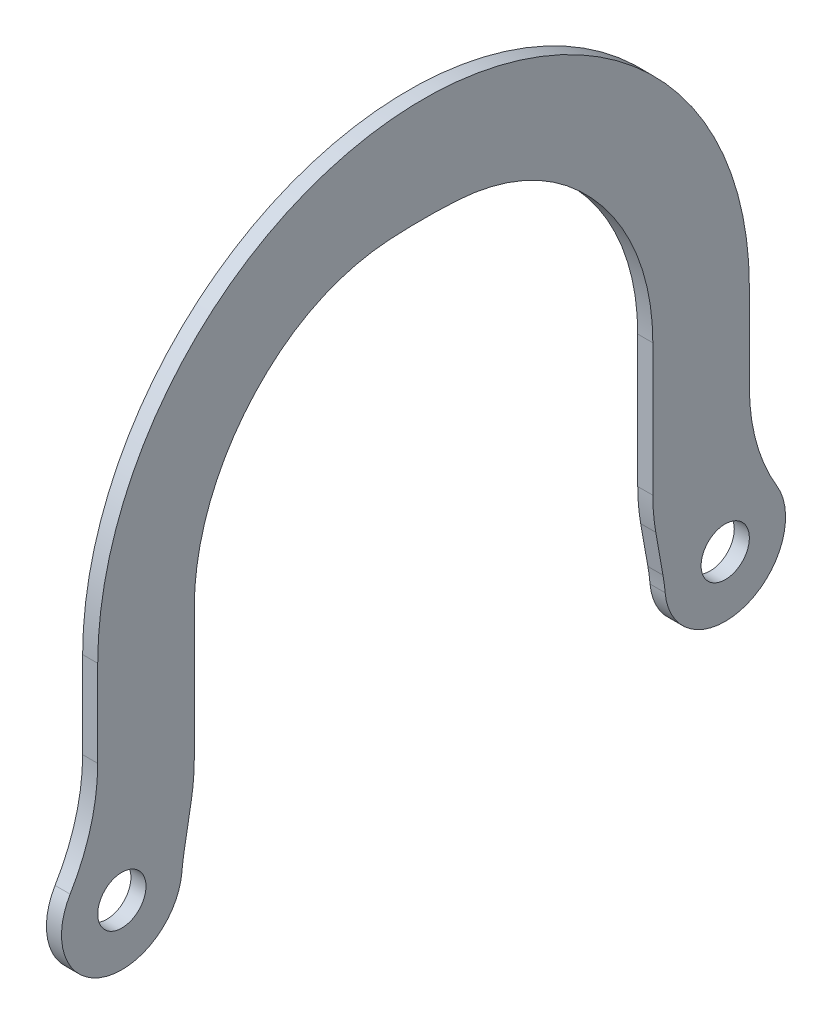
ISO-10303-21;
HEADER;
FILE_DESCRIPTION(('STEP AP214'),'2;1');
FILE_NAME('part.step','',(''),(''),'','','');
FILE_SCHEMA(('AUTOMOTIVE_DESIGN { 1 0 10303 214 1 1 1 1 }'));
ENDSEC;
DATA;
#1=APPLICATION_CONTEXT('core data for automotive mechanical design processes');
#2=APPLICATION_PROTOCOL_DEFINITION('international standard','automotive_design',2000,#1);
#3=PRODUCT_CONTEXT('',#1,'mechanical');
#4=PRODUCT('Part','Part','',(#3));
#5=PRODUCT_RELATED_PRODUCT_CATEGORY('part','',(#4));
#6=PRODUCT_DEFINITION_FORMATION('','',#4);
#7=PRODUCT_DEFINITION_CONTEXT('part definition',#1,'design');
#8=PRODUCT_DEFINITION('design','',#6,#7);
#9=PRODUCT_DEFINITION_SHAPE('','',#8);
#10=(LENGTH_UNIT() NAMED_UNIT(*) SI_UNIT(.MILLI.,.METRE.));
#11=(NAMED_UNIT(*) PLANE_ANGLE_UNIT() SI_UNIT($,.RADIAN.));
#12=(NAMED_UNIT(*) SI_UNIT($,.STERADIAN.) SOLID_ANGLE_UNIT());
#13=UNCERTAINTY_MEASURE_WITH_UNIT(LENGTH_MEASURE(1.E-05),#10,'distance_accuracy_value','');
#14=(GEOMETRIC_REPRESENTATION_CONTEXT(3) GLOBAL_UNCERTAINTY_ASSIGNED_CONTEXT((#13)) GLOBAL_UNIT_ASSIGNED_CONTEXT((#10,
#11,#12)) REPRESENTATION_CONTEXT('',''));
#15=CARTESIAN_POINT('',(0.,0.,0.));
#16=DIRECTION('',(0.,0.,1.));
#17=DIRECTION('',(1.,0.,0.));
#18=AXIS2_PLACEMENT_3D('',#15,#16,#17);
#19=CARTESIAN_POINT('',(-1.984375,-28.575,30.1625));
#20=DIRECTION('',(0.,0.,-1.));
#21=DIRECTION('',(0.,1.,0.));
#22=AXIS2_PLACEMENT_3D('',#19,#20,#21);
#23=PLANE('',#22);
#24=DIRECTION('',(0.,1.,0.));
#25=VECTOR('',#24,1.);
#26=CARTESIAN_POINT('',(0.,-28.575,30.1625));
#27=LINE('',#26,#25);
#28=CARTESIAN_POINT('',(0.,-17.3669505939713,30.1625));
#29=VERTEX_POINT('',#28);
#30=CARTESIAN_POINT('',(0.,0.,30.1625));
#31=VERTEX_POINT('',#30);
#32=EDGE_CURVE('E192',#29,#31,#27,.T.);
#33=ORIENTED_EDGE('',*,*,#32,.F.);
#34=DIRECTION('',(1.,0.,0.));
#35=VECTOR('',#34,1.);
#36=CARTESIAN_POINT('',(-1.984375,-17.3669505939713,30.1625));
#37=LINE('',#36,#35);
#38=CARTESIAN_POINT('',(-1.984375,-17.3669505939713,30.1625));
#39=VERTEX_POINT('',#38);
#40=EDGE_CURVE('E57',#29,#39,#37,.F.);
#41=ORIENTED_EDGE('',*,*,#40,.T.);
#42=DIRECTION('',(0.,1.,0.));
#43=VECTOR('',#42,1.);
#44=CARTESIAN_POINT('',(-1.984375,-28.575,30.1625));
#45=LINE('',#44,#43);
#46=CARTESIAN_POINT('',(-1.984375,0.,30.1625));
#47=VERTEX_POINT('',#46);
#48=EDGE_CURVE('E203',#39,#47,#45,.T.);
#49=ORIENTED_EDGE('',*,*,#48,.T.);
#50=DIRECTION('',(1.,0.,0.));
#51=VECTOR('',#50,1.);
#52=CARTESIAN_POINT('',(-1.984375,0.,30.1625));
#53=LINE('',#52,#51);
#54=EDGE_CURVE('E236',#47,#31,#53,.T.);
#55=ORIENTED_EDGE('',*,*,#54,.T.);
#56=EDGE_LOOP('',(#33,#41,#49,#55));
#57=FACE_BOUND('',#56,.T.);
#58=ADVANCED_FACE('F42',(#57),#23,.T.);
#59=CARTESIAN_POINT('',(-1.984375,0.,0.));
#60=DIRECTION('',(1.,0.,0.));
#61=DIRECTION('',(0.,0.,-1.));
#62=AXIS2_PLACEMENT_3D('',#59,#60,#61);
#63=PLANE('',#62);
#64=CARTESIAN_POINT('',(-1.98437499999998,-28.575,-39.6875));
#65=DIRECTION('',(1.,0.,0.));
#66=DIRECTION('',(0.,0.,-1.));
#67=AXIS2_PLACEMENT_3D('',#64,#65,#66);
#68=CIRCLE('',#67,3.17499999999996);
#69=CARTESIAN_POINT('',(-1.98437499999998,-28.575,-42.8625));
#70=VERTEX_POINT('',#69);
#71=EDGE_CURVE('E368',#70,#70,#68,.T.);
#72=ORIENTED_EDGE('',*,*,#71,.T.);
#73=EDGE_LOOP('',(#72));
#74=FACE_BOUND('',#73,.T.);
#75=CARTESIAN_POINT('',(-1.98437499999998,-28.575,39.6875));
#76=DIRECTION('',(1.,0.,0.));
#77=DIRECTION('',(0.,0.,-1.));
#78=AXIS2_PLACEMENT_3D('',#75,#76,#77);
#79=CIRCLE('',#78,3.17499999999996);
#80=CARTESIAN_POINT('',(-1.98437499999998,-28.575,36.5125));
#81=VERTEX_POINT('',#80);
#82=EDGE_CURVE('E363',#81,#81,#79,.T.);
#83=ORIENTED_EDGE('',*,*,#82,.T.);
#84=EDGE_LOOP('',(#83));
#85=FACE_BOUND('',#84,.T.);
#86=DIRECTION('',(0.,0.984731927834662,0.174077655955698));
#87=VECTOR('',#86,1.);
#88=CARTESIAN_POINT('',(-1.984375,4.57667037640555,-25.8895572672956));
#89=LINE('',#88,#87);
#90=CARTESIAN_POINT('',(-1.984375,-27.138992724705,-31.4961473794514));
#91=VERTEX_POINT('',#90);
#92=CARTESIAN_POINT('',(-1.984375,-21.7885230552461,-30.5503090329996));
#93=VERTEX_POINT('',#92);
#94=EDGE_CURVE('E320',#91,#93,#89,.T.);
#95=ORIENTED_EDGE('',*,*,#94,.T.);
#96=CARTESIAN_POINT('',(-1.984375,-17.3669505939714,-55.5625));
#97=DIRECTION('',(1.,0.,0.));
#98=DIRECTION('',(0.,0.,-1.));
#99=AXIS2_PLACEMENT_3D('',#96,#97,#98);
#100=CIRCLE('',#99,25.4);
#101=CARTESIAN_POINT('',(-1.984375,-17.3669505939714,-30.1625));
#102=VERTEX_POINT('',#101);
#103=EDGE_CURVE('E208',#93,#102,#100,.F.);
#104=ORIENTED_EDGE('',*,*,#103,.T.);
#105=DIRECTION('',(0.,-1.,0.));
#106=VECTOR('',#105,1.);
#107=CARTESIAN_POINT('',(-1.984375,0.,-30.1625));
#108=LINE('',#107,#106);
#109=CARTESIAN_POINT('',(-1.984375,0.,-30.1625));
#110=VERTEX_POINT('',#109);
#111=EDGE_CURVE('E198',#110,#102,#108,.T.);
#112=ORIENTED_EDGE('',*,*,#111,.F.);
#113=CARTESIAN_POINT('',(-1.984375,0.,0.));
#114=DIRECTION('',(-1.,0.,0.));
#115=DIRECTION('',(0.,0.,-1.));
#116=AXIS2_PLACEMENT_3D('',#113,#114,#115);
#117=CIRCLE('',#116,30.1625);
#118=CARTESIAN_POINT('',(-1.984375,23.5376002290003,-18.8615424000733));
#119=VERTEX_POINT('',#118);
#120=EDGE_CURVE('E180',#119,#110,#117,.T.);
#121=ORIENTED_EDGE('',*,*,#120,.F.);
#122=CARTESIAN_POINT('',(-1.984375,3.71646319405269,-2.97813827369579));
#123=DIRECTION('',(1.,0.,0.));
#124=DIRECTION('',(0.,0.,-1.));
#125=AXIS2_PLACEMENT_3D('',#122,#123,#124);
#126=CIRCLE('',#125,25.4);
#127=CARTESIAN_POINT('',(-1.984375,29.068713643419,-4.53486469558426));
#128=VERTEX_POINT('',#127);
#129=EDGE_CURVE('E254',#119,#128,#126,.T.);
#130=ORIENTED_EDGE('',*,*,#129,.T.);
#131=CARTESIAN_POINT('',(-1.984375,-44.784356427154,0.));
#132=DIRECTION('',(1.,0.,0.));
#133=DIRECTION('',(0.,0.,-1.));
#134=AXIS2_PLACEMENT_3D('',#131,#132,#133);
#135=CIRCLE('',#134,73.9921682116169);
#136=CARTESIAN_POINT('',(-1.984375,29.068713643419,4.53486469558424));
#137=VERTEX_POINT('',#136);
#138=EDGE_CURVE('E356',#128,#137,#135,.T.);
#139=ORIENTED_EDGE('',*,*,#138,.T.);
#140=CARTESIAN_POINT('',(-1.984375,3.71646319405269,2.97813827369577));
#141=DIRECTION('',(1.,0.,0.));
#142=DIRECTION('',(0.,0.,-1.));
#143=AXIS2_PLACEMENT_3D('',#140,#141,#142);
#144=CIRCLE('',#143,25.4);
#145=CARTESIAN_POINT('',(-1.984375,23.5376002290004,18.8615424000732));
#146=VERTEX_POINT('',#145);
#147=EDGE_CURVE('E258',#137,#146,#144,.T.);
#148=ORIENTED_EDGE('',*,*,#147,.T.);
#149=EDGE_CURVE('E191',#47,#146,#117,.T.);
#150=ORIENTED_EDGE('',*,*,#149,.F.);
#151=ORIENTED_EDGE('',*,*,#48,.F.);
#152=CARTESIAN_POINT('',(-1.984375,-17.3669505939713,55.5625));
#153=DIRECTION('',(1.,0.,0.));
#154=DIRECTION('',(0.,0.,-1.));
#155=AXIS2_PLACEMENT_3D('',#152,#153,#154);
#156=CIRCLE('',#155,25.4);
#157=CARTESIAN_POINT('',(-1.984375,-21.7885230552461,30.5503090329996));
#158=VERTEX_POINT('',#157);
#159=EDGE_CURVE('E276',#39,#158,#156,.F.);
#160=ORIENTED_EDGE('',*,*,#159,.T.);
#161=DIRECTION('',(0.,0.984731927834662,-0.174077655955697));
#162=VECTOR('',#161,1.);
#163=CARTESIAN_POINT('',(-1.984375,4.57667037640554,25.8895572672956));
#164=LINE('',#163,#162);
#165=CARTESIAN_POINT('',(-1.984375,-27.1389927247051,31.4961473794514));
#166=VERTEX_POINT('',#165);
#167=EDGE_CURVE('E357',#166,#158,#164,.T.);
#168=ORIENTED_EDGE('',*,*,#167,.F.);
#169=CARTESIAN_POINT('',(-1.984375,-31.5605651859798,6.48395641245102));
#170=DIRECTION('',(1.,0.,0.));
#171=DIRECTION('',(0.,0.,-1.));
#172=AXIS2_PLACEMENT_3D('',#169,#170,#171);
#173=CIRCLE('',#172,25.4);
#174=CARTESIAN_POINT('',(-1.984375,-29.2858488538047,31.7818943839169));
#175=VERTEX_POINT('',#174);
#176=EDGE_CURVE('E304',#166,#175,#173,.T.);
#177=ORIENTED_EDGE('',*,*,#176,.T.);
#178=CARTESIAN_POINT('',(-1.984375,-28.575,39.6875));
#179=DIRECTION('',(1.,0.,0.));
#180=DIRECTION('',(0.,0.,-1.));
#181=AXIS2_PLACEMENT_3D('',#178,#179,#180);
#182=CIRCLE('',#181,7.9375);
#183=CARTESIAN_POINT('',(-1.984375,-24.4865623930006,46.4910714285714));
#184=VERTEX_POINT('',#183);
#185=EDGE_CURVE('E325',#184,#175,#182,.T.);
#186=ORIENTED_EDGE('',*,*,#185,.F.);
#187=CARTESIAN_POINT('',(-1.984375,-11.4035620506027,68.2625));
#188=DIRECTION('',(1.,0.,0.));
#189=DIRECTION('',(0.,0.,-1.));
#190=AXIS2_PLACEMENT_3D('',#187,#188,#189);
#191=CIRCLE('',#190,25.4);
#192=CARTESIAN_POINT('',(-1.984375,-11.4035620506027,42.8625));
#193=VERTEX_POINT('',#192);
#194=EDGE_CURVE('E11',#184,#193,#191,.T.);
#195=ORIENTED_EDGE('',*,*,#194,.T.);
#196=DIRECTION('',(0.,-1.,0.));
#197=VECTOR('',#196,1.);
#198=CARTESIAN_POINT('',(-1.984375,0.,42.8625));
#199=LINE('',#198,#197);
#200=CARTESIAN_POINT('',(-1.984375,0.,42.8625));
#201=VERTEX_POINT('',#200);
#202=EDGE_CURVE('E218',#201,#193,#199,.T.);
#203=ORIENTED_EDGE('',*,*,#202,.F.);
#204=CARTESIAN_POINT('',(-1.984375,0.,0.));
#205=DIRECTION('',(1.,0.,0.));
#206=DIRECTION('',(0.,0.,-1.));
#207=AXIS2_PLACEMENT_3D('',#204,#205,#206);
#208=CIRCLE('',#207,42.8625);
#209=CARTESIAN_POINT('',(-1.984375,0.,-42.8625));
#210=VERTEX_POINT('',#209);
#211=EDGE_CURVE('E211',#210,#201,#208,.T.);
#212=ORIENTED_EDGE('',*,*,#211,.F.);
#213=DIRECTION('',(0.,1.,0.));
#214=VECTOR('',#213,1.);
#215=CARTESIAN_POINT('',(-1.984375,-19.5947438789308,-42.8625));
#216=LINE('',#215,#214);
#217=CARTESIAN_POINT('',(-1.984375,-11.4035620506027,-42.8625));
#218=VERTEX_POINT('',#217);
#219=EDGE_CURVE('E209',#218,#210,#216,.T.);
#220=ORIENTED_EDGE('',*,*,#219,.F.);
#221=CARTESIAN_POINT('',(-1.984375,-11.4035620506027,-68.2625));
#222=DIRECTION('',(1.,0.,0.));
#223=DIRECTION('',(0.,0.,-1.));
#224=AXIS2_PLACEMENT_3D('',#221,#222,#223);
#225=CIRCLE('',#224,25.4);
#226=CARTESIAN_POINT('',(-1.984375,-24.4865623930006,-46.4910714285714));
#227=VERTEX_POINT('',#226);
#228=EDGE_CURVE('E300',#218,#227,#225,.T.);
#229=ORIENTED_EDGE('',*,*,#228,.T.);
#230=CARTESIAN_POINT('',(-1.984375,-28.575,-39.6875));
#231=DIRECTION('',(1.,0.,0.));
#232=DIRECTION('',(0.,0.,-1.));
#233=AXIS2_PLACEMENT_3D('',#230,#231,#232);
#234=CIRCLE('',#233,7.9375);
#235=CARTESIAN_POINT('',(-1.984375,-29.2858488538047,-31.7818943839169));
#236=VERTEX_POINT('',#235);
#237=EDGE_CURVE('E344',#236,#227,#234,.T.);
#238=ORIENTED_EDGE('',*,*,#237,.F.);
#239=CARTESIAN_POINT('',(-1.984375,-31.5605651859797,-6.48395641245101));
#240=DIRECTION('',(1.,0.,0.));
#241=DIRECTION('',(0.,0.,-1.));
#242=AXIS2_PLACEMENT_3D('',#239,#240,#241);
#243=CIRCLE('',#242,25.4);
#244=EDGE_CURVE('E296',#236,#91,#243,.T.);
#245=ORIENTED_EDGE('',*,*,#244,.T.);
#246=EDGE_LOOP('',(#95,#104,#112,#121,#130,#139,#148,#150,#151,#160,#168,#177,#186,#195,#203,
#212,#220,#229,#238,#245));
#247=FACE_BOUND('',#246,.T.);
#248=ADVANCED_FACE('F206',(#74,#85,#247),#63,.F.);
#249=CARTESIAN_POINT('',(0.,0.,0.));
#250=DIRECTION('',(1.,0.,0.));
#251=DIRECTION('',(0.,0.,-1.));
#252=AXIS2_PLACEMENT_3D('',#249,#250,#251);
#253=PLANE('',#252);
#254=CARTESIAN_POINT('',(0.,-28.575,39.6875));
#255=DIRECTION('',(1.,0.,0.));
#256=DIRECTION('',(0.,0.,-1.));
#257=AXIS2_PLACEMENT_3D('',#254,#255,#256);
#258=CIRCLE('',#257,3.17499999999999);
#259=CARTESIAN_POINT('',(0.,-28.575,36.5125));
#260=VERTEX_POINT('',#259);
#261=EDGE_CURVE('E360',#260,#260,#258,.T.);
#262=ORIENTED_EDGE('',*,*,#261,.F.);
#263=EDGE_LOOP('',(#262));
#264=FACE_BOUND('',#263,.T.);
#265=CARTESIAN_POINT('',(0.,-28.575,-39.6875));
#266=DIRECTION('',(1.,0.,0.));
#267=DIRECTION('',(0.,0.,-1.));
#268=AXIS2_PLACEMENT_3D('',#265,#266,#267);
#269=CIRCLE('',#268,3.17499999999999);
#270=CARTESIAN_POINT('',(0.,-28.575,-42.8625));
#271=VERTEX_POINT('',#270);
#272=EDGE_CURVE('E366',#271,#271,#269,.T.);
#273=ORIENTED_EDGE('',*,*,#272,.F.);
#274=EDGE_LOOP('',(#273));
#275=FACE_BOUND('',#274,.T.);
#276=DIRECTION('',(0.,-1.,0.));
#277=VECTOR('',#276,1.);
#278=CARTESIAN_POINT('',(0.,0.,-30.1625));
#279=LINE('',#278,#277);
#280=CARTESIAN_POINT('',(0.,0.,-30.1625));
#281=VERTEX_POINT('',#280);
#282=CARTESIAN_POINT('',(0.,-17.3669505939714,-30.1625));
#283=VERTEX_POINT('',#282);
#284=EDGE_CURVE('E201',#281,#283,#279,.T.);
#285=ORIENTED_EDGE('',*,*,#284,.T.);
#286=CARTESIAN_POINT('',(0.,-17.3669505939714,-55.5625));
#287=DIRECTION('',(1.,0.,0.));
#288=DIRECTION('',(0.,0.,-1.));
#289=AXIS2_PLACEMENT_3D('',#286,#287,#288);
#290=CIRCLE('',#289,25.4);
#291=CARTESIAN_POINT('',(0.,-21.7885230552461,-30.5503090329996));
#292=VERTEX_POINT('',#291);
#293=EDGE_CURVE('E274',#283,#292,#290,.T.);
#294=ORIENTED_EDGE('',*,*,#293,.T.);
#295=DIRECTION('',(0.,0.984731927834662,0.174077655955698));
#296=VECTOR('',#295,1.);
#297=CARTESIAN_POINT('',(0.,4.57667037640555,-25.8895572672956));
#298=LINE('',#297,#296);
#299=CARTESIAN_POINT('',(0.,-27.138992724705,-31.4961473794514));
#300=VERTEX_POINT('',#299);
#301=EDGE_CURVE('E346',#300,#292,#298,.T.);
#302=ORIENTED_EDGE('',*,*,#301,.F.);
#303=CARTESIAN_POINT('',(0.,-31.5605651859797,-6.48395641245101));
#304=DIRECTION('',(1.,0.,0.));
#305=DIRECTION('',(0.,0.,-1.));
#306=AXIS2_PLACEMENT_3D('',#303,#304,#305);
#307=CIRCLE('',#306,25.4);
#308=CARTESIAN_POINT('',(0.,-29.2858488538047,-31.7818943839169));
#309=VERTEX_POINT('',#308);
#310=EDGE_CURVE('E294',#300,#309,#307,.F.);
#311=ORIENTED_EDGE('',*,*,#310,.T.);
#312=CARTESIAN_POINT('',(0.,-28.575,-39.6875));
#313=DIRECTION('',(1.,0.,0.));
#314=DIRECTION('',(0.,0.,-1.));
#315=AXIS2_PLACEMENT_3D('',#312,#313,#314);
#316=CIRCLE('',#315,7.9375);
#317=CARTESIAN_POINT('',(0.,-24.4865623930006,-46.4910714285714));
#318=VERTEX_POINT('',#317);
#319=EDGE_CURVE('E342',#309,#318,#316,.T.);
#320=ORIENTED_EDGE('',*,*,#319,.T.);
#321=CARTESIAN_POINT('',(0.,-11.4035620506027,-68.2625));
#322=DIRECTION('',(1.,0.,0.));
#323=DIRECTION('',(0.,0.,-1.));
#324=AXIS2_PLACEMENT_3D('',#321,#322,#323);
#325=CIRCLE('',#324,25.4);
#326=CARTESIAN_POINT('',(0.,-11.4035620506027,-42.8625));
#327=VERTEX_POINT('',#326);
#328=EDGE_CURVE('E298',#318,#327,#325,.F.);
#329=ORIENTED_EDGE('',*,*,#328,.T.);
#330=DIRECTION('',(0.,1.,0.));
#331=VECTOR('',#330,1.);
#332=CARTESIAN_POINT('',(0.,-19.5947438789308,-42.8625));
#333=LINE('',#332,#331);
#334=CARTESIAN_POINT('',(0.,0.,-42.8625));
#335=VERTEX_POINT('',#334);
#336=EDGE_CURVE('E227',#327,#335,#333,.T.);
#337=ORIENTED_EDGE('',*,*,#336,.T.);
#338=CARTESIAN_POINT('',(0.,0.,0.));
#339=DIRECTION('',(1.,0.,0.));
#340=DIRECTION('',(0.,0.,-1.));
#341=AXIS2_PLACEMENT_3D('',#338,#339,#340);
#342=CIRCLE('',#341,42.8625);
#343=CARTESIAN_POINT('',(0.,0.,42.8625));
#344=VERTEX_POINT('',#343);
#345=EDGE_CURVE('E229',#335,#344,#342,.T.);
#346=ORIENTED_EDGE('',*,*,#345,.T.);
#347=DIRECTION('',(0.,-1.,0.));
#348=VECTOR('',#347,1.);
#349=CARTESIAN_POINT('',(0.,0.,42.8625));
#350=LINE('',#349,#348);
#351=CARTESIAN_POINT('',(0.,-11.4035620506027,42.8625));
#352=VERTEX_POINT('',#351);
#353=EDGE_CURVE('E232',#344,#352,#350,.T.);
#354=ORIENTED_EDGE('',*,*,#353,.T.);
#355=CARTESIAN_POINT('',(0.,-11.4035620506027,68.2625));
#356=DIRECTION('',(1.,0.,0.));
#357=DIRECTION('',(0.,0.,-1.));
#358=AXIS2_PLACEMENT_3D('',#355,#356,#357);
#359=CIRCLE('',#358,25.4);
#360=CARTESIAN_POINT('',(0.,-24.4865623930006,46.4910714285714));
#361=VERTEX_POINT('',#360);
#362=EDGE_CURVE('E50',#352,#361,#359,.F.);
#363=ORIENTED_EDGE('',*,*,#362,.T.);
#364=CARTESIAN_POINT('',(0.,-28.575,39.6875));
#365=DIRECTION('',(1.,0.,0.));
#366=DIRECTION('',(0.,0.,-1.));
#367=AXIS2_PLACEMENT_3D('',#364,#365,#366);
#368=CIRCLE('',#367,7.9375);
#369=CARTESIAN_POINT('',(0.,-29.2858488538047,31.7818943839169));
#370=VERTEX_POINT('',#369);
#371=EDGE_CURVE('E309',#361,#370,#368,.T.);
#372=ORIENTED_EDGE('',*,*,#371,.T.);
#373=CARTESIAN_POINT('',(0.,-31.5605651859798,6.48395641245102));
#374=DIRECTION('',(1.,0.,0.));
#375=DIRECTION('',(0.,0.,-1.));
#376=AXIS2_PLACEMENT_3D('',#373,#374,#375);
#377=CIRCLE('',#376,25.4);
#378=CARTESIAN_POINT('',(0.,-27.1389927247051,31.4961473794514));
#379=VERTEX_POINT('',#378);
#380=EDGE_CURVE('E302',#370,#379,#377,.F.);
#381=ORIENTED_EDGE('',*,*,#380,.T.);
#382=DIRECTION('',(0.,0.984731927834662,-0.174077655955697));
#383=VECTOR('',#382,1.);
#384=CARTESIAN_POINT('',(0.,4.57667037640554,25.8895572672956));
#385=LINE('',#384,#383);
#386=CARTESIAN_POINT('',(0.,-21.7885230552461,30.5503090329996));
#387=VERTEX_POINT('',#386);
#388=EDGE_CURVE('E319',#379,#387,#385,.T.);
#389=ORIENTED_EDGE('',*,*,#388,.T.);
#390=CARTESIAN_POINT('',(0.,-17.3669505939713,55.5625));
#391=DIRECTION('',(1.,0.,0.));
#392=DIRECTION('',(0.,0.,-1.));
#393=AXIS2_PLACEMENT_3D('',#390,#391,#392);
#394=CIRCLE('',#393,25.4);
#395=EDGE_CURVE('E272',#387,#29,#394,.T.);
#396=ORIENTED_EDGE('',*,*,#395,.T.);
#397=ORIENTED_EDGE('',*,*,#32,.T.);
#398=CARTESIAN_POINT('',(0.,0.,0.));
#399=DIRECTION('',(-1.,0.,0.));
#400=DIRECTION('',(0.,0.,-1.));
#401=AXIS2_PLACEMENT_3D('',#398,#399,#400);
#402=CIRCLE('',#401,30.1625);
#403=CARTESIAN_POINT('',(0.,23.5376002290004,18.8615424000732));
#404=VERTEX_POINT('',#403);
#405=EDGE_CURVE('E222',#31,#404,#402,.T.);
#406=ORIENTED_EDGE('',*,*,#405,.T.);
#407=CARTESIAN_POINT('',(0.,3.71646319405269,2.97813827369577));
#408=DIRECTION('',(1.,0.,0.));
#409=DIRECTION('',(0.,0.,-1.));
#410=AXIS2_PLACEMENT_3D('',#407,#408,#409);
#411=CIRCLE('',#410,25.4);
#412=CARTESIAN_POINT('',(0.,29.068713643419,4.53486469558424));
#413=VERTEX_POINT('',#412);
#414=EDGE_CURVE('E256',#404,#413,#411,.F.);
#415=ORIENTED_EDGE('',*,*,#414,.T.);
#416=CARTESIAN_POINT('',(0.,-44.784356427154,0.));
#417=DIRECTION('',(1.,0.,0.));
#418=DIRECTION('',(0.,0.,-1.));
#419=AXIS2_PLACEMENT_3D('',#416,#417,#418);
#420=CIRCLE('',#419,73.9921682116169);
#421=CARTESIAN_POINT('',(0.,29.068713643419,-4.53486469558426));
#422=VERTEX_POINT('',#421);
#423=EDGE_CURVE('E353',#413,#422,#420,.F.);
#424=ORIENTED_EDGE('',*,*,#423,.T.);
#425=CARTESIAN_POINT('',(0.,3.71646319405269,-2.97813827369579));
#426=DIRECTION('',(1.,0.,0.));
#427=DIRECTION('',(0.,0.,-1.));
#428=AXIS2_PLACEMENT_3D('',#425,#426,#427);
#429=CIRCLE('',#428,25.4);
#430=CARTESIAN_POINT('',(0.,23.5376002290003,-18.8615424000733));
#431=VERTEX_POINT('',#430);
#432=EDGE_CURVE('E252',#422,#431,#429,.F.);
#433=ORIENTED_EDGE('',*,*,#432,.T.);
#434=EDGE_CURVE('E225',#431,#281,#402,.T.);
#435=ORIENTED_EDGE('',*,*,#434,.T.);
#436=EDGE_LOOP('',(#285,#294,#302,#311,#320,#329,#337,#346,#354,#363,#372,#381,#389,#396,#397,
#406,#415,#424,#433,#435));
#437=FACE_BOUND('',#436,.T.);
#438=ADVANCED_FACE('F308',(#264,#275,#437),#253,.T.);
#439=CARTESIAN_POINT('',(-1.984375,0.,0.));
#440=DIRECTION('',(1.,0.,0.));
#441=DIRECTION('',(0.,0.,-1.));
#442=AXIS2_PLACEMENT_3D('',#439,#440,#441);
#443=CYLINDRICAL_SURFACE('',#442,30.1625);
#444=ORIENTED_EDGE('',*,*,#434,.F.);
#445=DIRECTION('',(1.,0.,0.));
#446=VECTOR('',#445,1.);
#447=CARTESIAN_POINT('',(-1.984375,23.5376002290003,-18.8615424000733));
#448=LINE('',#447,#446);
#449=EDGE_CURVE('E187',#431,#119,#448,.F.);
#450=ORIENTED_EDGE('',*,*,#449,.T.);
#451=ORIENTED_EDGE('',*,*,#120,.T.);
#452=DIRECTION('',(1.,0.,0.));
#453=VECTOR('',#452,1.);
#454=CARTESIAN_POINT('',(-1.984375,0.,-30.1625));
#455=LINE('',#454,#453);
#456=EDGE_CURVE('E184',#110,#281,#455,.T.);
#457=ORIENTED_EDGE('',*,*,#456,.T.);
#458=EDGE_LOOP('',(#444,#450,#451,#457));
#459=FACE_BOUND('',#458,.T.);
#460=ADVANCED_FACE('F183',(#459),#443,.F.);
#461=ORIENTED_EDGE('',*,*,#149,.T.);
#462=DIRECTION('',(1.,0.,0.));
#463=VECTOR('',#462,1.);
#464=CARTESIAN_POINT('',(-1.984375,23.5376002290004,18.8615424000732));
#465=LINE('',#464,#463);
#466=EDGE_CURVE('E249',#146,#404,#465,.T.);
#467=ORIENTED_EDGE('',*,*,#466,.T.);
#468=ORIENTED_EDGE('',*,*,#405,.F.);
#469=ORIENTED_EDGE('',*,*,#54,.F.);
#470=EDGE_LOOP('',(#461,#467,#468,#469));
#471=FACE_BOUND('',#470,.T.);
#472=ADVANCED_FACE('F387',(#471),#443,.F.);
#473=CARTESIAN_POINT('',(-1.984375,0.,42.8625));
#474=DIRECTION('',(0.,0.,1.));
#475=DIRECTION('',(0.,-1.,0.));
#476=AXIS2_PLACEMENT_3D('',#473,#474,#475);
#477=PLANE('',#476);
#478=ORIENTED_EDGE('',*,*,#202,.T.);
#479=DIRECTION('',(-1.,0.,0.));
#480=VECTOR('',#479,1.);
#481=CARTESIAN_POINT('',(0.,-11.4035620506027,42.8625));
#482=LINE('',#481,#480);
#483=EDGE_CURVE('E291',#193,#352,#482,.F.);
#484=ORIENTED_EDGE('',*,*,#483,.T.);
#485=ORIENTED_EDGE('',*,*,#353,.F.);
#486=DIRECTION('',(1.,0.,0.));
#487=VECTOR('',#486,1.);
#488=CARTESIAN_POINT('',(-1.984375,0.,42.8625));
#489=LINE('',#488,#487);
#490=EDGE_CURVE('E240',#201,#344,#489,.T.);
#491=ORIENTED_EDGE('',*,*,#490,.F.);
#492=EDGE_LOOP('',(#478,#484,#485,#491));
#493=FACE_BOUND('',#492,.T.);
#494=ADVANCED_FACE('F327',(#493),#477,.T.);
#495=CARTESIAN_POINT('',(-1.984375,0.,0.));
#496=DIRECTION('',(1.,0.,0.));
#497=DIRECTION('',(0.,0.,-1.));
#498=AXIS2_PLACEMENT_3D('',#495,#496,#497);
#499=CYLINDRICAL_SURFACE('',#498,42.8625);
#500=ORIENTED_EDGE('',*,*,#345,.F.);
#501=DIRECTION('',(1.,0.,0.));
#502=VECTOR('',#501,1.);
#503=CARTESIAN_POINT('',(-1.984375,0.,-42.8625));
#504=LINE('',#503,#502);
#505=EDGE_CURVE('E202',#210,#335,#504,.T.);
#506=ORIENTED_EDGE('',*,*,#505,.F.);
#507=ORIENTED_EDGE('',*,*,#211,.T.);
#508=ORIENTED_EDGE('',*,*,#490,.T.);
#509=EDGE_LOOP('',(#500,#506,#507,#508));
#510=FACE_BOUND('',#509,.T.);
#511=ADVANCED_FACE('F330',(#510),#499,.T.);
#512=CARTESIAN_POINT('',(-1.984375,-19.5947438789308,-42.8625));
#513=DIRECTION('',(0.,0.,-1.));
#514=DIRECTION('',(-1.,0.,0.));
#515=AXIS2_PLACEMENT_3D('',#512,#513,#514);
#516=PLANE('',#515);
#517=ORIENTED_EDGE('',*,*,#336,.F.);
#518=DIRECTION('',(-1.,0.,0.));
#519=VECTOR('',#518,1.);
#520=CARTESIAN_POINT('',(-1.984375,-11.4035620506027,-42.8625));
#521=LINE('',#520,#519);
#522=EDGE_CURVE('E65',#327,#218,#521,.T.);
#523=ORIENTED_EDGE('',*,*,#522,.T.);
#524=ORIENTED_EDGE('',*,*,#219,.T.);
#525=ORIENTED_EDGE('',*,*,#505,.T.);
#526=EDGE_LOOP('',(#517,#523,#524,#525));
#527=FACE_BOUND('',#526,.T.);
#528=ADVANCED_FACE('F434',(#527),#516,.T.);
#529=CARTESIAN_POINT('',(-1.984375,0.,-30.1625));
#530=DIRECTION('',(0.,0.,1.));
#531=DIRECTION('',(0.,-1.,0.));
#532=AXIS2_PLACEMENT_3D('',#529,#530,#531);
#533=PLANE('',#532);
#534=ORIENTED_EDGE('',*,*,#111,.T.);
#535=DIRECTION('',(1.,0.,0.));
#536=VECTOR('',#535,1.);
#537=CARTESIAN_POINT('',(0.,-17.3669505939714,-30.1625));
#538=LINE('',#537,#536);
#539=EDGE_CURVE('E270',#102,#283,#538,.T.);
#540=ORIENTED_EDGE('',*,*,#539,.T.);
#541=ORIENTED_EDGE('',*,*,#284,.F.);
#542=ORIENTED_EDGE('',*,*,#456,.F.);
#543=EDGE_LOOP('',(#534,#540,#541,#542));
#544=FACE_BOUND('',#543,.T.);
#545=ADVANCED_FACE('F196',(#544),#533,.T.);
#546=CARTESIAN_POINT('',(0.,-28.575,-39.6875));
#547=DIRECTION('',(1.,0.,0.));
#548=DIRECTION('',(0.,0.,-1.));
#549=AXIS2_PLACEMENT_3D('',#546,#547,#548);
#550=CYLINDRICAL_SURFACE('',#549,3.17499999999997);
#551=ORIENTED_EDGE('',*,*,#71,.F.);
#552=EDGE_LOOP('',(#551));
#553=FACE_BOUND('',#552,.T.);
#554=ORIENTED_EDGE('',*,*,#272,.T.);
#555=EDGE_LOOP('',(#554));
#556=FACE_BOUND('',#555,.T.);
#557=ADVANCED_FACE('F439',(#553,#556),#550,.F.);
#558=CARTESIAN_POINT('',(0.,-28.575,39.6875));
#559=DIRECTION('',(1.,0.,0.));
#560=DIRECTION('',(0.,0.,-1.));
#561=AXIS2_PLACEMENT_3D('',#558,#559,#560);
#562=CYLINDRICAL_SURFACE('',#561,3.17499999999997);
#563=ORIENTED_EDGE('',*,*,#82,.F.);
#564=EDGE_LOOP('',(#563));
#565=FACE_BOUND('',#564,.T.);
#566=ORIENTED_EDGE('',*,*,#261,.T.);
#567=EDGE_LOOP('',(#566));
#568=FACE_BOUND('',#567,.T.);
#569=ADVANCED_FACE('F456',(#565,#568),#562,.F.);
#570=CARTESIAN_POINT('',(-21.3622820399771,-44.784356427154,0.));
#571=DIRECTION('',(1.,0.,0.));
#572=DIRECTION('',(0.,0.,-1.));
#573=AXIS2_PLACEMENT_3D('',#570,#571,#572);
#574=CYLINDRICAL_SURFACE('',#573,73.9921682116169);
#575=ORIENTED_EDGE('',*,*,#138,.F.);
#576=DIRECTION('',(1.,0.,0.));
#577=VECTOR('',#576,1.);
#578=CARTESIAN_POINT('',(-21.3622820399771,29.068713643419,-4.53486469558426));
#579=LINE('',#578,#577);
#580=EDGE_CURVE('E245',#128,#422,#579,.T.);
#581=ORIENTED_EDGE('',*,*,#580,.T.);
#582=ORIENTED_EDGE('',*,*,#423,.F.);
#583=DIRECTION('',(1.,0.,0.));
#584=VECTOR('',#583,1.);
#585=CARTESIAN_POINT('',(-21.3622820399771,29.068713643419,4.53486469558424));
#586=LINE('',#585,#584);
#587=EDGE_CURVE('E239',#413,#137,#586,.F.);
#588=ORIENTED_EDGE('',*,*,#587,.T.);
#589=EDGE_LOOP('',(#575,#581,#582,#588));
#590=FACE_BOUND('',#589,.T.);
#591=ADVANCED_FACE('F378',(#590),#574,.F.);
#592=CARTESIAN_POINT('',(-1.984375,3.71646319405269,-2.97813827369579));
#593=DIRECTION('',(-1.,0.,0.));
#594=DIRECTION('',(0.,0.,1.));
#595=AXIS2_PLACEMENT_3D('',#592,#593,#594);
#596=CYLINDRICAL_SURFACE('',#595,25.4);
#597=ORIENTED_EDGE('',*,*,#129,.F.);
#598=ORIENTED_EDGE('',*,*,#449,.F.);
#599=ORIENTED_EDGE('',*,*,#432,.F.);
#600=ORIENTED_EDGE('',*,*,#580,.F.);
#601=EDGE_LOOP('',(#597,#598,#599,#600));
#602=FACE_BOUND('',#601,.T.);
#603=ADVANCED_FACE('F373',(#602),#596,.F.);
#604=CARTESIAN_POINT('',(-21.3622820399771,3.71646319405269,2.97813827369577));
#605=DIRECTION('',(-1.,0.,0.));
#606=DIRECTION('',(0.,0.,1.));
#607=AXIS2_PLACEMENT_3D('',#604,#605,#606);
#608=CYLINDRICAL_SURFACE('',#607,25.4);
#609=ORIENTED_EDGE('',*,*,#147,.F.);
#610=ORIENTED_EDGE('',*,*,#587,.F.);
#611=ORIENTED_EDGE('',*,*,#414,.F.);
#612=ORIENTED_EDGE('',*,*,#466,.F.);
#613=EDGE_LOOP('',(#609,#610,#611,#612));
#614=FACE_BOUND('',#613,.T.);
#615=ADVANCED_FACE('F382',(#614),#608,.F.);
#616=CARTESIAN_POINT('',(-1.984375,-28.575,-39.6875));
#617=DIRECTION('',(1.,0.,0.));
#618=DIRECTION('',(0.,0.,-1.));
#619=AXIS2_PLACEMENT_3D('',#616,#617,#618);
#620=CYLINDRICAL_SURFACE('',#619,7.9375);
#621=ORIENTED_EDGE('',*,*,#319,.F.);
#622=DIRECTION('',(1.,0.,0.));
#623=VECTOR('',#622,1.);
#624=CARTESIAN_POINT('',(-1.984375,-29.2858488538047,-31.7818943839169));
#625=LINE('',#624,#623);
#626=EDGE_CURVE('E268',#309,#236,#625,.F.);
#627=ORIENTED_EDGE('',*,*,#626,.T.);
#628=ORIENTED_EDGE('',*,*,#237,.T.);
#629=DIRECTION('',(1.,0.,0.));
#630=VECTOR('',#629,1.);
#631=CARTESIAN_POINT('',(-1.984375,-24.4865623930006,-46.4910714285714));
#632=LINE('',#631,#630);
#633=EDGE_CURVE('E265',#227,#318,#632,.T.);
#634=ORIENTED_EDGE('',*,*,#633,.T.);
#635=EDGE_LOOP('',(#621,#627,#628,#634));
#636=FACE_BOUND('',#635,.T.);
#637=ADVANCED_FACE('F341',(#636),#620,.T.);
#638=CARTESIAN_POINT('',(-1.984375,4.57667037640555,-25.8895572672956));
#639=DIRECTION('',(0.,0.174077655955698,-0.984731927834662));
#640=DIRECTION('',(0.,0.984731927834662,0.174077655955698));
#641=AXIS2_PLACEMENT_3D('',#638,#639,#640);
#642=PLANE('',#641);
#643=ORIENTED_EDGE('',*,*,#94,.F.);
#644=DIRECTION('',(1.,0.,0.));
#645=VECTOR('',#644,1.);
#646=CARTESIAN_POINT('',(-1.984375,-27.138992724705,-31.4961473794514));
#647=LINE('',#646,#645);
#648=EDGE_CURVE('E262',#91,#300,#647,.T.);
#649=ORIENTED_EDGE('',*,*,#648,.T.);
#650=ORIENTED_EDGE('',*,*,#301,.T.);
#651=DIRECTION('',(1.,0.,0.));
#652=VECTOR('',#651,1.);
#653=CARTESIAN_POINT('',(-1.984375,-21.7885230552461,-30.5503090329996));
#654=LINE('',#653,#652);
#655=EDGE_CURVE('E260',#292,#93,#654,.F.);
#656=ORIENTED_EDGE('',*,*,#655,.T.);
#657=EDGE_LOOP('',(#643,#649,#650,#656));
#658=FACE_BOUND('',#657,.T.);
#659=ADVANCED_FACE('F410',(#658),#642,.F.);
#660=CARTESIAN_POINT('',(-1.984375,-28.575,39.6875));
#661=DIRECTION('',(1.,0.,0.));
#662=DIRECTION('',(0.,0.,-1.));
#663=AXIS2_PLACEMENT_3D('',#660,#661,#662);
#664=CYLINDRICAL_SURFACE('',#663,7.9375);
#665=ORIENTED_EDGE('',*,*,#185,.T.);
#666=DIRECTION('',(1.,0.,0.));
#667=VECTOR('',#666,1.);
#668=CARTESIAN_POINT('',(-1.984375,-29.2858488538047,31.7818943839169));
#669=LINE('',#668,#667);
#670=EDGE_CURVE('E282',#175,#370,#669,.T.);
#671=ORIENTED_EDGE('',*,*,#670,.T.);
#672=ORIENTED_EDGE('',*,*,#371,.F.);
#673=DIRECTION('',(1.,0.,0.));
#674=VECTOR('',#673,1.);
#675=CARTESIAN_POINT('',(-1.984375,-24.4865623930006,46.4910714285714));
#676=LINE('',#675,#674);
#677=EDGE_CURVE('E280',#361,#184,#676,.F.);
#678=ORIENTED_EDGE('',*,*,#677,.T.);
#679=EDGE_LOOP('',(#665,#671,#672,#678));
#680=FACE_BOUND('',#679,.T.);
#681=ADVANCED_FACE('F316',(#680),#664,.T.);
#682=CARTESIAN_POINT('',(-1.984375,4.57667037640554,25.8895572672956));
#683=DIRECTION('',(0.,-0.174077655955697,-0.984731927834662));
#684=DIRECTION('',(0.,0.984731927834662,-0.174077655955697));
#685=AXIS2_PLACEMENT_3D('',#682,#683,#684);
#686=PLANE('',#685);
#687=ORIENTED_EDGE('',*,*,#388,.F.);
#688=DIRECTION('',(-1.,0.,0.));
#689=VECTOR('',#688,1.);
#690=CARTESIAN_POINT('',(-1.984375,-27.138992724705,31.4961473794514));
#691=LINE('',#690,#689);
#692=EDGE_CURVE('E288',#379,#166,#691,.T.);
#693=ORIENTED_EDGE('',*,*,#692,.T.);
#694=ORIENTED_EDGE('',*,*,#167,.T.);
#695=DIRECTION('',(1.,0.,0.));
#696=VECTOR('',#695,1.);
#697=CARTESIAN_POINT('',(-1.984375,-21.7885230552461,30.5503090329996));
#698=LINE('',#697,#696);
#699=EDGE_CURVE('E285',#158,#387,#698,.T.);
#700=ORIENTED_EDGE('',*,*,#699,.T.);
#701=EDGE_LOOP('',(#687,#693,#694,#700));
#702=FACE_BOUND('',#701,.T.);
#703=ADVANCED_FACE('F398',(#702),#686,.T.);
#704=CARTESIAN_POINT('',(-1.984375,-31.5605651859797,-6.48395641245101));
#705=DIRECTION('',(1.,0.,0.));
#706=DIRECTION('',(0.,0.,-1.));
#707=AXIS2_PLACEMENT_3D('',#704,#705,#706);
#708=CYLINDRICAL_SURFACE('',#707,25.4);
#709=ORIENTED_EDGE('',*,*,#244,.F.);
#710=ORIENTED_EDGE('',*,*,#626,.F.);
#711=ORIENTED_EDGE('',*,*,#310,.F.);
#712=ORIENTED_EDGE('',*,*,#648,.F.);
#713=EDGE_LOOP('',(#709,#710,#711,#712));
#714=FACE_BOUND('',#713,.T.);
#715=ADVANCED_FACE('F412',(#714),#708,.F.);
#716=CARTESIAN_POINT('',(-1.984375,-17.3669505939714,-55.5625));
#717=DIRECTION('',(-1.,0.,0.));
#718=DIRECTION('',(0.,0.,1.));
#719=AXIS2_PLACEMENT_3D('',#716,#717,#718);
#720=CYLINDRICAL_SURFACE('',#719,25.4);
#721=ORIENTED_EDGE('',*,*,#103,.F.);
#722=ORIENTED_EDGE('',*,*,#655,.F.);
#723=ORIENTED_EDGE('',*,*,#293,.F.);
#724=ORIENTED_EDGE('',*,*,#539,.F.);
#725=EDGE_LOOP('',(#721,#722,#723,#724));
#726=FACE_BOUND('',#725,.T.);
#727=ADVANCED_FACE('F409',(#726),#720,.T.);
#728=CARTESIAN_POINT('',(-1.984375,-11.4035620506027,-68.2625));
#729=DIRECTION('',(1.,0.,0.));
#730=DIRECTION('',(0.,0.,-1.));
#731=AXIS2_PLACEMENT_3D('',#728,#729,#730);
#732=CYLINDRICAL_SURFACE('',#731,25.4);
#733=ORIENTED_EDGE('',*,*,#228,.F.);
#734=ORIENTED_EDGE('',*,*,#522,.F.);
#735=ORIENTED_EDGE('',*,*,#328,.F.);
#736=ORIENTED_EDGE('',*,*,#633,.F.);
#737=EDGE_LOOP('',(#733,#734,#735,#736));
#738=FACE_BOUND('',#737,.T.);
#739=ADVANCED_FACE('F337',(#738),#732,.F.);
#740=CARTESIAN_POINT('',(-1.984375,-31.5605651859798,6.48395641245102));
#741=DIRECTION('',(1.,0.,0.));
#742=DIRECTION('',(0.,0.,-1.));
#743=AXIS2_PLACEMENT_3D('',#740,#741,#742);
#744=CYLINDRICAL_SURFACE('',#743,25.4);
#745=ORIENTED_EDGE('',*,*,#176,.F.);
#746=ORIENTED_EDGE('',*,*,#692,.F.);
#747=ORIENTED_EDGE('',*,*,#380,.F.);
#748=ORIENTED_EDGE('',*,*,#670,.F.);
#749=EDGE_LOOP('',(#745,#746,#747,#748));
#750=FACE_BOUND('',#749,.T.);
#751=ADVANCED_FACE('F547',(#750),#744,.F.);
#752=CARTESIAN_POINT('',(-1.984375,-17.3669505939713,55.5625));
#753=DIRECTION('',(1.,0.,0.));
#754=DIRECTION('',(0.,0.,-1.));
#755=AXIS2_PLACEMENT_3D('',#752,#753,#754);
#756=CYLINDRICAL_SURFACE('',#755,25.4);
#757=ORIENTED_EDGE('',*,*,#159,.F.);
#758=ORIENTED_EDGE('',*,*,#40,.F.);
#759=ORIENTED_EDGE('',*,*,#395,.F.);
#760=ORIENTED_EDGE('',*,*,#699,.F.);
#761=EDGE_LOOP('',(#757,#758,#759,#760));
#762=FACE_BOUND('',#761,.T.);
#763=ADVANCED_FACE('F394',(#762),#756,.T.);
#764=CARTESIAN_POINT('',(-1.984375,-11.4035620506027,68.2625));
#765=DIRECTION('',(1.,0.,0.));
#766=DIRECTION('',(0.,0.,-1.));
#767=AXIS2_PLACEMENT_3D('',#764,#765,#766);
#768=CYLINDRICAL_SURFACE('',#767,25.4);
#769=ORIENTED_EDGE('',*,*,#194,.F.);
#770=ORIENTED_EDGE('',*,*,#677,.F.);
#771=ORIENTED_EDGE('',*,*,#362,.F.);
#772=ORIENTED_EDGE('',*,*,#483,.F.);
#773=EDGE_LOOP('',(#769,#770,#771,#772));
#774=FACE_BOUND('',#773,.T.);
#775=ADVANCED_FACE('F44',(#774),#768,.F.);
#776=CLOSED_SHELL('',(#58,#248,#438,#460,#472,#494,#511,#528,#545,#557,#569,#591,#603,#615,#637,
#659,#681,#703,#715,#727,#739,#751,#763,#775));
#777=MANIFOLD_SOLID_BREP('B2',#776);
#778=ADVANCED_BREP_SHAPE_REPRESENTATION('',(#18,#777),#14);
#779=SHAPE_DEFINITION_REPRESENTATION(#9,#778);
ENDSEC;
END-ISO-10303-21;
